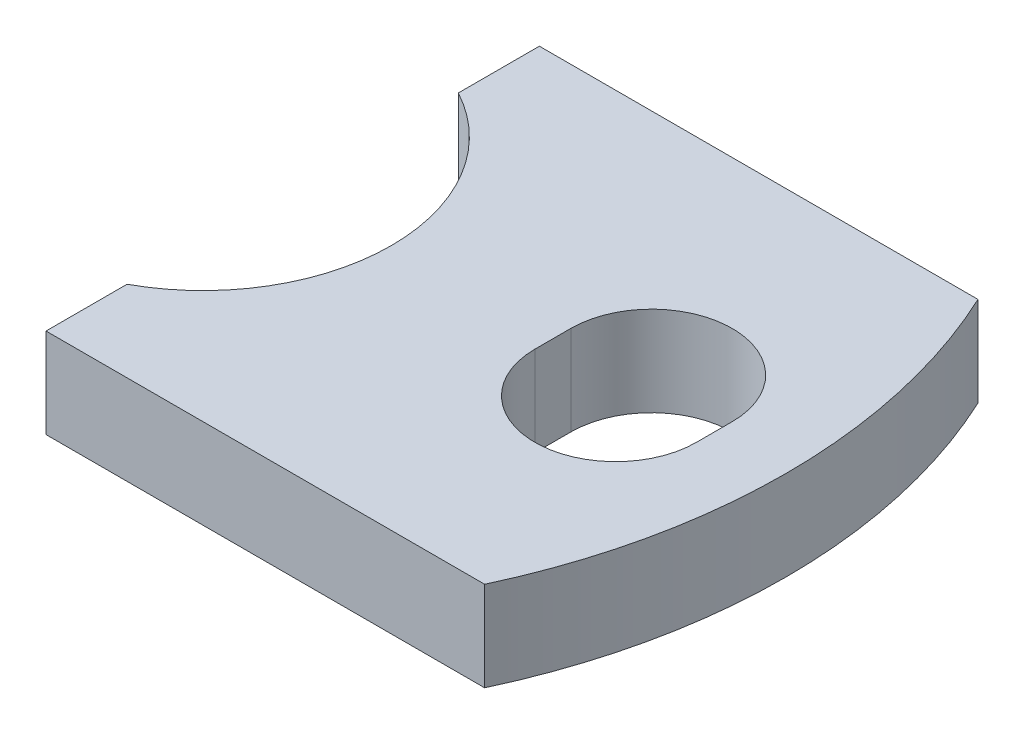
ISO-10303-21;
HEADER;
FILE_DESCRIPTION(('STEP AP214'),'2;1');
FILE_NAME('part.step','',(''),(''),'','','');
FILE_SCHEMA(('AUTOMOTIVE_DESIGN { 1 0 10303 214 1 1 1 1 }'));
ENDSEC;
DATA;
#1=APPLICATION_CONTEXT('core data for automotive mechanical design processes');
#2=APPLICATION_PROTOCOL_DEFINITION('international standard','automotive_design',2000,#1);
#3=PRODUCT_CONTEXT('',#1,'mechanical');
#4=PRODUCT('Part','Part','',(#3));
#5=PRODUCT_RELATED_PRODUCT_CATEGORY('part','',(#4));
#6=PRODUCT_DEFINITION_FORMATION('','',#4);
#7=PRODUCT_DEFINITION_CONTEXT('part definition',#1,'design');
#8=PRODUCT_DEFINITION('design','',#6,#7);
#9=PRODUCT_DEFINITION_SHAPE('','',#8);
#10=(LENGTH_UNIT() NAMED_UNIT(*) SI_UNIT(.MILLI.,.METRE.));
#11=(NAMED_UNIT(*) PLANE_ANGLE_UNIT() SI_UNIT($,.RADIAN.));
#12=(NAMED_UNIT(*) SI_UNIT($,.STERADIAN.) SOLID_ANGLE_UNIT());
#13=UNCERTAINTY_MEASURE_WITH_UNIT(LENGTH_MEASURE(1.E-05),#10,'distance_accuracy_value','');
#14=(GEOMETRIC_REPRESENTATION_CONTEXT(3) GLOBAL_UNCERTAINTY_ASSIGNED_CONTEXT((#13)) GLOBAL_UNIT_ASSIGNED_CONTEXT((#10,
#11,#12)) REPRESENTATION_CONTEXT('',''));
#15=CARTESIAN_POINT('',(0.,0.,0.));
#16=DIRECTION('',(0.,0.,1.));
#17=DIRECTION('',(1.,0.,0.));
#18=AXIS2_PLACEMENT_3D('',#15,#16,#17);
#19=CARTESIAN_POINT('',(-2.75,1.,2.75));
#20=DIRECTION('',(1.,0.,0.));
#21=DIRECTION('',(0.,0.,-1.));
#22=AXIS2_PLACEMENT_3D('',#19,#20,#21);
#23=PLANE('',#22);
#24=DIRECTION('',(0.,0.,1.));
#25=VECTOR('',#24,1.);
#26=CARTESIAN_POINT('',(-2.75,0.,2.75));
#27=LINE('',#26,#25);
#28=CARTESIAN_POINT('',(-2.75,0.,-2.75));
#29=VERTEX_POINT('',#28);
#30=CARTESIAN_POINT('',(-2.75,0.,-1.84661853126194));
#31=VERTEX_POINT('',#30);
#32=EDGE_CURVE('E129',#29,#31,#27,.T.);
#33=ORIENTED_EDGE('',*,*,#32,.T.);
#34=DIRECTION('',(0.,1.,0.));
#35=VECTOR('',#34,1.);
#36=CARTESIAN_POINT('',(-2.75,0.,-1.84661853126194));
#37=LINE('',#36,#35);
#38=CARTESIAN_POINT('',(-2.75,1.,-1.84661853126194));
#39=VERTEX_POINT('',#38);
#40=EDGE_CURVE('E47',#31,#39,#37,.T.);
#41=ORIENTED_EDGE('',*,*,#40,.T.);
#42=DIRECTION('',(0.,0.,1.));
#43=VECTOR('',#42,1.);
#44=CARTESIAN_POINT('',(-2.75,1.,2.75));
#45=LINE('',#44,#43);
#46=CARTESIAN_POINT('',(-2.75,1.,-2.75));
#47=VERTEX_POINT('',#46);
#48=EDGE_CURVE('E147',#47,#39,#45,.T.);
#49=ORIENTED_EDGE('',*,*,#48,.F.);
#50=DIRECTION('',(0.,-1.,0.));
#51=VECTOR('',#50,1.);
#52=CARTESIAN_POINT('',(-2.75,1.,-2.75));
#53=LINE('',#52,#51);
#54=EDGE_CURVE('E40',#47,#29,#53,.T.);
#55=ORIENTED_EDGE('',*,*,#54,.T.);
#56=EDGE_LOOP('',(#33,#41,#49,#55));
#57=FACE_BOUND('',#56,.T.);
#58=ADVANCED_FACE('F32',(#57),#23,.F.);
#59=CARTESIAN_POINT('',(-2.75,1.,-2.75));
#60=DIRECTION('',(0.,0.,1.));
#61=DIRECTION('',(1.,0.,0.));
#62=AXIS2_PLACEMENT_3D('',#59,#60,#61);
#63=PLANE('',#62);
#64=DIRECTION('',(-1.,0.,0.));
#65=VECTOR('',#64,1.);
#66=CARTESIAN_POINT('',(-2.75,1.,-2.75));
#67=LINE('',#66,#65);
#68=CARTESIAN_POINT('',(2.13960949469487,1.,-2.75));
#69=VERTEX_POINT('',#68);
#70=EDGE_CURVE('E122',#69,#47,#67,.T.);
#71=ORIENTED_EDGE('',*,*,#70,.F.);
#72=DIRECTION('',(0.,1.,0.));
#73=VECTOR('',#72,1.);
#74=CARTESIAN_POINT('',(2.13960949469487,0.,-2.75));
#75=LINE('',#74,#73);
#76=CARTESIAN_POINT('',(2.13960949469487,0.,-2.75));
#77=VERTEX_POINT('',#76);
#78=EDGE_CURVE('E110',#77,#69,#75,.T.);
#79=ORIENTED_EDGE('',*,*,#78,.F.);
#80=DIRECTION('',(-1.,0.,0.));
#81=VECTOR('',#80,1.);
#82=CARTESIAN_POINT('',(-2.75,0.,-2.75));
#83=LINE('',#82,#81);
#84=EDGE_CURVE('E120',#77,#29,#83,.T.);
#85=ORIENTED_EDGE('',*,*,#84,.T.);
#86=ORIENTED_EDGE('',*,*,#54,.F.);
#87=EDGE_LOOP('',(#71,#79,#85,#86));
#88=FACE_BOUND('',#87,.T.);
#89=ADVANCED_FACE('F34',(#88),#63,.F.);
#90=CARTESIAN_POINT('',(-2.75,1.,1.84661853126194));
#91=VERTEX_POINT('',#90);
#92=CARTESIAN_POINT('',(-2.75,1.,2.75));
#93=VERTEX_POINT('',#92);
#94=EDGE_CURVE('E150',#91,#93,#45,.T.);
#95=ORIENTED_EDGE('',*,*,#94,.F.);
#96=DIRECTION('',(0.,1.,0.));
#97=VECTOR('',#96,1.);
#98=CARTESIAN_POINT('',(-2.75,0.,1.84661853126194));
#99=LINE('',#98,#97);
#100=CARTESIAN_POINT('',(-2.75,0.,1.84661853126194));
#101=VERTEX_POINT('',#100);
#102=EDGE_CURVE('E171',#101,#91,#99,.T.);
#103=ORIENTED_EDGE('',*,*,#102,.F.);
#104=CARTESIAN_POINT('',(-2.75,0.,2.75));
#105=VERTEX_POINT('',#104);
#106=EDGE_CURVE('E130',#101,#105,#27,.T.);
#107=ORIENTED_EDGE('',*,*,#106,.T.);
#108=DIRECTION('',(0.,-1.,0.));
#109=VECTOR('',#108,1.);
#110=CARTESIAN_POINT('',(-2.75,1.,2.75));
#111=LINE('',#110,#109);
#112=EDGE_CURVE('E142',#93,#105,#111,.T.);
#113=ORIENTED_EDGE('',*,*,#112,.F.);
#114=EDGE_LOOP('',(#95,#103,#107,#113));
#115=FACE_BOUND('',#114,.T.);
#116=ADVANCED_FACE('F197',(#115),#23,.F.);
#117=CARTESIAN_POINT('',(-2.75,1.,2.75));
#118=DIRECTION('',(0.,0.,-1.));
#119=DIRECTION('',(-1.,0.,0.));
#120=AXIS2_PLACEMENT_3D('',#117,#118,#119);
#121=PLANE('',#120);
#122=DIRECTION('',(1.,0.,0.));
#123=VECTOR('',#122,1.);
#124=CARTESIAN_POINT('',(-2.75,0.,2.75));
#125=LINE('',#124,#123);
#126=CARTESIAN_POINT('',(2.13960949469487,0.,2.75));
#127=VERTEX_POINT('',#126);
#128=EDGE_CURVE('E140',#105,#127,#125,.T.);
#129=ORIENTED_EDGE('',*,*,#128,.T.);
#130=DIRECTION('',(0.,1.,0.));
#131=VECTOR('',#130,1.);
#132=CARTESIAN_POINT('',(2.13960949469487,0.,2.75));
#133=LINE('',#132,#131);
#134=CARTESIAN_POINT('',(2.13960949469487,1.,2.75));
#135=VERTEX_POINT('',#134);
#136=EDGE_CURVE('E113',#127,#135,#133,.T.);
#137=ORIENTED_EDGE('',*,*,#136,.T.);
#138=DIRECTION('',(1.,0.,0.));
#139=VECTOR('',#138,1.);
#140=CARTESIAN_POINT('',(-2.75,1.,2.75));
#141=LINE('',#140,#139);
#142=EDGE_CURVE('E137',#93,#135,#141,.T.);
#143=ORIENTED_EDGE('',*,*,#142,.F.);
#144=ORIENTED_EDGE('',*,*,#112,.T.);
#145=EDGE_LOOP('',(#129,#137,#143,#144));
#146=FACE_BOUND('',#145,.T.);
#147=ADVANCED_FACE('F191',(#146),#121,.F.);
#148=CARTESIAN_POINT('',(0.,1.,0.));
#149=DIRECTION('',(0.,-1.,0.));
#150=DIRECTION('',(0.,0.,-1.));
#151=AXIS2_PLACEMENT_3D('',#148,#149,#150);
#152=PLANE('',#151);
#153=DIRECTION('',(0.,0.,-1.));
#154=VECTOR('',#153,1.);
#155=CARTESIAN_POINT('',(1.95,1.,0.2));
#156=LINE('',#155,#154);
#157=CARTESIAN_POINT('',(1.95,1.,0.2));
#158=VERTEX_POINT('',#157);
#159=CARTESIAN_POINT('',(1.95,1.,-0.2));
#160=VERTEX_POINT('',#159);
#161=EDGE_CURVE('E167',#158,#160,#156,.T.);
#162=ORIENTED_EDGE('',*,*,#161,.F.);
#163=CARTESIAN_POINT('',(1.05,1.,0.2));
#164=DIRECTION('',(0.,1.,0.));
#165=DIRECTION('',(0.,0.,1.));
#166=AXIS2_PLACEMENT_3D('',#163,#164,#165);
#167=CIRCLE('',#166,0.9);
#168=CARTESIAN_POINT('',(0.15,1.,0.2));
#169=VERTEX_POINT('',#168);
#170=EDGE_CURVE('E55',#169,#158,#167,.T.);
#171=ORIENTED_EDGE('',*,*,#170,.F.);
#172=DIRECTION('',(0.,0.,1.));
#173=VECTOR('',#172,1.);
#174=CARTESIAN_POINT('',(0.15,1.,0.2));
#175=LINE('',#174,#173);
#176=CARTESIAN_POINT('',(0.15,1.,-0.2));
#177=VERTEX_POINT('',#176);
#178=EDGE_CURVE('E160',#177,#169,#175,.T.);
#179=ORIENTED_EDGE('',*,*,#178,.F.);
#180=CARTESIAN_POINT('',(1.05,1.,-0.2));
#181=DIRECTION('',(0.,1.,0.));
#182=DIRECTION('',(0.,0.,1.));
#183=AXIS2_PLACEMENT_3D('',#180,#181,#182);
#184=CIRCLE('',#183,0.9);
#185=EDGE_CURVE('E164',#160,#177,#184,.T.);
#186=ORIENTED_EDGE('',*,*,#185,.F.);
#187=EDGE_LOOP('',(#162,#171,#179,#186));
#188=FACE_BOUND('',#187,.T.);
#189=ORIENTED_EDGE('',*,*,#142,.T.);
#190=CARTESIAN_POINT('',(-3.75,1.,0.));
#191=DIRECTION('',(0.,-1.,0.));
#192=DIRECTION('',(0.,0.,1.));
#193=AXIS2_PLACEMENT_3D('',#190,#191,#192);
#194=CIRCLE('',#193,6.5);
#195=EDGE_CURVE('E123',#69,#135,#194,.T.);
#196=ORIENTED_EDGE('',*,*,#195,.F.);
#197=ORIENTED_EDGE('',*,*,#70,.T.);
#198=ORIENTED_EDGE('',*,*,#48,.T.);
#199=CARTESIAN_POINT('',(-3.75,1.,0.));
#200=DIRECTION('',(0.,1.,0.));
#201=DIRECTION('',(0.,0.,1.));
#202=AXIS2_PLACEMENT_3D('',#199,#200,#201);
#203=CIRCLE('',#202,2.1);
#204=EDGE_CURVE('E185',#91,#39,#203,.T.);
#205=ORIENTED_EDGE('',*,*,#204,.F.);
#206=ORIENTED_EDGE('',*,*,#94,.T.);
#207=EDGE_LOOP('',(#189,#196,#197,#198,#205,#206));
#208=FACE_BOUND('',#207,.T.);
#209=ADVANCED_FACE('F192',(#188,#208),#152,.F.);
#210=CARTESIAN_POINT('',(0.,0.,0.));
#211=DIRECTION('',(0.,-1.,0.));
#212=DIRECTION('',(0.,0.,-1.));
#213=AXIS2_PLACEMENT_3D('',#210,#211,#212);
#214=PLANE('',#213);
#215=CARTESIAN_POINT('',(-3.75,0.,0.));
#216=DIRECTION('',(0.,-1.,0.));
#217=DIRECTION('',(0.,0.,-1.));
#218=AXIS2_PLACEMENT_3D('',#215,#216,#217);
#219=CIRCLE('',#218,6.5);
#220=EDGE_CURVE('E11',#127,#77,#219,.F.);
#221=ORIENTED_EDGE('',*,*,#220,.F.);
#222=ORIENTED_EDGE('',*,*,#128,.F.);
#223=ORIENTED_EDGE('',*,*,#106,.F.);
#224=CARTESIAN_POINT('',(-3.75,0.,0.));
#225=DIRECTION('',(0.,1.,0.));
#226=DIRECTION('',(0.,0.,1.));
#227=AXIS2_PLACEMENT_3D('',#224,#225,#226);
#228=CIRCLE('',#227,2.1);
#229=EDGE_CURVE('E183',#101,#31,#228,.T.);
#230=ORIENTED_EDGE('',*,*,#229,.T.);
#231=ORIENTED_EDGE('',*,*,#32,.F.);
#232=ORIENTED_EDGE('',*,*,#84,.F.);
#233=EDGE_LOOP('',(#221,#222,#223,#230,#231,#232));
#234=FACE_BOUND('',#233,.T.);
#235=CARTESIAN_POINT('',(1.05,0.,0.2));
#236=DIRECTION('',(0.,1.,0.));
#237=DIRECTION('',(0.,0.,1.));
#238=AXIS2_PLACEMENT_3D('',#235,#236,#237);
#239=CIRCLE('',#238,0.9);
#240=CARTESIAN_POINT('',(0.15,0.,0.2));
#241=VERTEX_POINT('',#240);
#242=CARTESIAN_POINT('',(1.95,0.,0.2));
#243=VERTEX_POINT('',#242);
#244=EDGE_CURVE('E163',#241,#243,#239,.T.);
#245=ORIENTED_EDGE('',*,*,#244,.T.);
#246=DIRECTION('',(0.,0.,-1.));
#247=VECTOR('',#246,1.);
#248=CARTESIAN_POINT('',(1.95,0.,0.2));
#249=LINE('',#248,#247);
#250=CARTESIAN_POINT('',(1.95,0.,-0.2));
#251=VERTEX_POINT('',#250);
#252=EDGE_CURVE('E177',#243,#251,#249,.T.);
#253=ORIENTED_EDGE('',*,*,#252,.T.);
#254=CARTESIAN_POINT('',(1.05,0.,-0.2));
#255=DIRECTION('',(0.,1.,0.));
#256=DIRECTION('',(0.,0.,1.));
#257=AXIS2_PLACEMENT_3D('',#254,#255,#256);
#258=CIRCLE('',#257,0.9);
#259=CARTESIAN_POINT('',(0.15,0.,-0.2));
#260=VERTEX_POINT('',#259);
#261=EDGE_CURVE('E174',#251,#260,#258,.T.);
#262=ORIENTED_EDGE('',*,*,#261,.T.);
#263=DIRECTION('',(0.,0.,1.));
#264=VECTOR('',#263,1.);
#265=CARTESIAN_POINT('',(0.15,0.,0.2));
#266=LINE('',#265,#264);
#267=EDGE_CURVE('E157',#260,#241,#266,.T.);
#268=ORIENTED_EDGE('',*,*,#267,.T.);
#269=EDGE_LOOP('',(#245,#253,#262,#268));
#270=FACE_BOUND('',#269,.T.);
#271=ADVANCED_FACE('F126',(#234,#270),#214,.T.);
#272=CARTESIAN_POINT('',(1.05,0.,0.2));
#273=DIRECTION('',(0.,1.,0.));
#274=DIRECTION('',(0.,0.,1.));
#275=AXIS2_PLACEMENT_3D('',#272,#273,#274);
#276=CYLINDRICAL_SURFACE('',#275,0.9);
#277=ORIENTED_EDGE('',*,*,#170,.T.);
#278=DIRECTION('',(0.,1.,0.));
#279=VECTOR('',#278,1.);
#280=CARTESIAN_POINT('',(1.95,0.,0.2));
#281=LINE('',#280,#279);
#282=EDGE_CURVE('E154',#243,#158,#281,.T.);
#283=ORIENTED_EDGE('',*,*,#282,.F.);
#284=ORIENTED_EDGE('',*,*,#244,.F.);
#285=DIRECTION('',(0.,1.,0.));
#286=VECTOR('',#285,1.);
#287=CARTESIAN_POINT('',(0.15,0.,0.2));
#288=LINE('',#287,#286);
#289=EDGE_CURVE('E131',#241,#169,#288,.T.);
#290=ORIENTED_EDGE('',*,*,#289,.T.);
#291=EDGE_LOOP('',(#277,#283,#284,#290));
#292=FACE_BOUND('',#291,.T.);
#293=ADVANCED_FACE('F228',(#292),#276,.F.);
#294=CARTESIAN_POINT('',(0.15,0.,0.2));
#295=DIRECTION('',(-1.,0.,0.));
#296=DIRECTION('',(0.,0.,1.));
#297=AXIS2_PLACEMENT_3D('',#294,#295,#296);
#298=PLANE('',#297);
#299=ORIENTED_EDGE('',*,*,#178,.T.);
#300=ORIENTED_EDGE('',*,*,#289,.F.);
#301=ORIENTED_EDGE('',*,*,#267,.F.);
#302=DIRECTION('',(0.,1.,0.));
#303=VECTOR('',#302,1.);
#304=CARTESIAN_POINT('',(0.15,0.,-0.2));
#305=LINE('',#304,#303);
#306=EDGE_CURVE('E134',#260,#177,#305,.T.);
#307=ORIENTED_EDGE('',*,*,#306,.T.);
#308=EDGE_LOOP('',(#299,#300,#301,#307));
#309=FACE_BOUND('',#308,.T.);
#310=ADVANCED_FACE('F231',(#309),#298,.F.);
#311=CARTESIAN_POINT('',(1.05,0.,-0.2));
#312=DIRECTION('',(0.,1.,0.));
#313=DIRECTION('',(0.,0.,1.));
#314=AXIS2_PLACEMENT_3D('',#311,#312,#313);
#315=CYLINDRICAL_SURFACE('',#314,0.9);
#316=ORIENTED_EDGE('',*,*,#185,.T.);
#317=ORIENTED_EDGE('',*,*,#306,.F.);
#318=ORIENTED_EDGE('',*,*,#261,.F.);
#319=DIRECTION('',(0.,1.,0.));
#320=VECTOR('',#319,1.);
#321=CARTESIAN_POINT('',(1.95,0.,-0.2));
#322=LINE('',#321,#320);
#323=EDGE_CURVE('E156',#251,#160,#322,.T.);
#324=ORIENTED_EDGE('',*,*,#323,.T.);
#325=EDGE_LOOP('',(#316,#317,#318,#324));
#326=FACE_BOUND('',#325,.T.);
#327=ADVANCED_FACE('F208',(#326),#315,.F.);
#328=CARTESIAN_POINT('',(1.95,0.,0.2));
#329=DIRECTION('',(1.,0.,0.));
#330=DIRECTION('',(0.,0.,-1.));
#331=AXIS2_PLACEMENT_3D('',#328,#329,#330);
#332=PLANE('',#331);
#333=ORIENTED_EDGE('',*,*,#161,.T.);
#334=ORIENTED_EDGE('',*,*,#323,.F.);
#335=ORIENTED_EDGE('',*,*,#252,.F.);
#336=ORIENTED_EDGE('',*,*,#282,.T.);
#337=EDGE_LOOP('',(#333,#334,#335,#336));
#338=FACE_BOUND('',#337,.T.);
#339=ADVANCED_FACE('F201',(#338),#332,.F.);
#340=CARTESIAN_POINT('',(-3.75,0.,0.));
#341=DIRECTION('',(0.,1.,0.));
#342=DIRECTION('',(0.,0.,1.));
#343=AXIS2_PLACEMENT_3D('',#340,#341,#342);
#344=CYLINDRICAL_SURFACE('',#343,2.1);
#345=ORIENTED_EDGE('',*,*,#204,.T.);
#346=ORIENTED_EDGE('',*,*,#40,.F.);
#347=ORIENTED_EDGE('',*,*,#229,.F.);
#348=ORIENTED_EDGE('',*,*,#102,.T.);
#349=EDGE_LOOP('',(#345,#346,#347,#348));
#350=FACE_BOUND('',#349,.T.);
#351=ADVANCED_FACE('F199',(#350),#344,.F.);
#352=CARTESIAN_POINT('',(-3.75,0.,0.));
#353=DIRECTION('',(0.,1.,0.));
#354=DIRECTION('',(0.,0.,1.));
#355=AXIS2_PLACEMENT_3D('',#352,#353,#354);
#356=CYLINDRICAL_SURFACE('',#355,6.5);
#357=ORIENTED_EDGE('',*,*,#195,.T.);
#358=ORIENTED_EDGE('',*,*,#136,.F.);
#359=ORIENTED_EDGE('',*,*,#220,.T.);
#360=ORIENTED_EDGE('',*,*,#78,.T.);
#361=EDGE_LOOP('',(#357,#358,#359,#360));
#362=FACE_BOUND('',#361,.T.);
#363=ADVANCED_FACE('F109',(#362),#356,.T.);
#364=CLOSED_SHELL('',(#58,#89,#116,#147,#209,#271,#293,#310,#327,#339,#351,#363));
#365=MANIFOLD_SOLID_BREP('B2',#364);
#366=ADVANCED_BREP_SHAPE_REPRESENTATION('',(#18,#365),#14);
#367=SHAPE_DEFINITION_REPRESENTATION(#9,#366);
ENDSEC;
END-ISO-10303-21;
